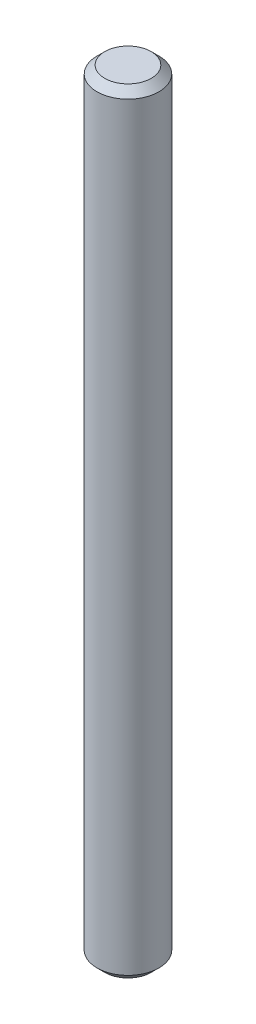
ISO-10303-21;
HEADER;
FILE_DESCRIPTION(('STEP AP214'),'2;1');
FILE_NAME('part.step','',(''),(''),'','','');
FILE_SCHEMA(('AUTOMOTIVE_DESIGN { 1 0 10303 214 1 1 1 1 }'));
ENDSEC;
DATA;
#1=APPLICATION_CONTEXT('core data for automotive mechanical design processes');
#2=APPLICATION_PROTOCOL_DEFINITION('international standard','automotive_design',2000,#1);
#3=PRODUCT_CONTEXT('',#1,'mechanical');
#4=PRODUCT('Part','Part','',(#3));
#5=PRODUCT_RELATED_PRODUCT_CATEGORY('part','',(#4));
#6=PRODUCT_DEFINITION_FORMATION('','',#4);
#7=PRODUCT_DEFINITION_CONTEXT('part definition',#1,'design');
#8=PRODUCT_DEFINITION('design','',#6,#7);
#9=PRODUCT_DEFINITION_SHAPE('','',#8);
#10=(LENGTH_UNIT() NAMED_UNIT(*) SI_UNIT(.MILLI.,.METRE.));
#11=(NAMED_UNIT(*) PLANE_ANGLE_UNIT() SI_UNIT($,.RADIAN.));
#12=(NAMED_UNIT(*) SI_UNIT($,.STERADIAN.) SOLID_ANGLE_UNIT());
#13=UNCERTAINTY_MEASURE_WITH_UNIT(LENGTH_MEASURE(1.E-05),#10,'distance_accuracy_value','');
#14=(GEOMETRIC_REPRESENTATION_CONTEXT(3) GLOBAL_UNCERTAINTY_ASSIGNED_CONTEXT((#13)) GLOBAL_UNIT_ASSIGNED_CONTEXT((#10,
#11,#12)) REPRESENTATION_CONTEXT('',''));
#15=CARTESIAN_POINT('',(0.,0.,0.));
#16=DIRECTION('',(0.,0.,1.));
#17=DIRECTION('',(1.,0.,0.));
#18=AXIS2_PLACEMENT_3D('',#15,#16,#17);
#19=CARTESIAN_POINT('',(0.,50.,0.));
#20=DIRECTION('',(0.,-1.,0.));
#21=DIRECTION('',(0.,0.,-1.));
#22=AXIS2_PLACEMENT_3D('',#19,#20,#21);
#23=CYLINDRICAL_SURFACE('',#22,2.);
#24=CARTESIAN_POINT('',(0.,0.499999999999994,0.));
#25=DIRECTION('',(0.,1.,0.));
#26=DIRECTION('',(0.,0.,1.));
#27=AXIS2_PLACEMENT_3D('',#24,#25,#26);
#28=CIRCLE('',#27,2.);
#29=CARTESIAN_POINT('',(0.,0.499999999999994,2.));
#30=VERTEX_POINT('',#29);
#31=EDGE_CURVE('E42',#30,#30,#28,.T.);
#32=ORIENTED_EDGE('',*,*,#31,.T.);
#33=EDGE_LOOP('',(#32));
#34=FACE_BOUND('',#33,.T.);
#35=CARTESIAN_POINT('',(0.,49.5,0.));
#36=DIRECTION('',(0.,1.,0.));
#37=DIRECTION('',(0.,0.,1.));
#38=AXIS2_PLACEMENT_3D('',#35,#36,#37);
#39=CIRCLE('',#38,2.);
#40=CARTESIAN_POINT('',(0.,49.5,2.));
#41=VERTEX_POINT('',#40);
#42=EDGE_CURVE('E46',#41,#41,#39,.F.);
#43=ORIENTED_EDGE('',*,*,#42,.T.);
#44=EDGE_LOOP('',(#43));
#45=FACE_BOUND('',#44,.T.);
#46=ADVANCED_FACE('F31',(#34,#45),#23,.T.);
#47=CARTESIAN_POINT('',(0.,50.,0.));
#48=DIRECTION('',(0.,1.,0.));
#49=DIRECTION('',(0.,0.,1.));
#50=AXIS2_PLACEMENT_3D('',#47,#48,#49);
#51=PLANE('',#50);
#52=CARTESIAN_POINT('',(0.,50.,0.));
#53=DIRECTION('',(0.,1.,0.));
#54=DIRECTION('',(0.,0.,1.));
#55=AXIS2_PLACEMENT_3D('',#52,#53,#54);
#56=CIRCLE('',#55,1.50000000000001);
#57=CARTESIAN_POINT('',(0.,50.,1.50000000000001));
#58=VERTEX_POINT('',#57);
#59=EDGE_CURVE('E10',#58,#58,#56,.T.);
#60=ORIENTED_EDGE('',*,*,#59,.T.);
#61=EDGE_LOOP('',(#60));
#62=FACE_BOUND('',#61,.T.);
#63=ADVANCED_FACE('F62',(#62),#51,.T.);
#64=CARTESIAN_POINT('',(0.,0.,0.));
#65=DIRECTION('',(0.,1.,0.));
#66=DIRECTION('',(0.,0.,1.));
#67=AXIS2_PLACEMENT_3D('',#64,#65,#66);
#68=PLANE('',#67);
#69=CARTESIAN_POINT('',(0.,0.,0.));
#70=DIRECTION('',(0.,1.,0.));
#71=DIRECTION('',(0.,0.,1.));
#72=AXIS2_PLACEMENT_3D('',#69,#70,#71);
#73=CIRCLE('',#72,1.50000000000001);
#74=CARTESIAN_POINT('',(0.,0.,1.50000000000001));
#75=VERTEX_POINT('',#74);
#76=EDGE_CURVE('E38',#75,#75,#73,.F.);
#77=ORIENTED_EDGE('',*,*,#76,.T.);
#78=EDGE_LOOP('',(#77));
#79=FACE_BOUND('',#78,.T.);
#80=ADVANCED_FACE('F59',(#79),#68,.F.);
#81=CARTESIAN_POINT('',(0.,0.499999999999994,0.));
#82=DIRECTION('',(0.,1.,0.));
#83=DIRECTION('',(0.,0.,1.));
#84=AXIS2_PLACEMENT_3D('',#81,#82,#83);
#85=CONICAL_SURFACE('',#84,2.,0.785398163397447);
#86=ORIENTED_EDGE('',*,*,#76,.F.);
#87=EDGE_LOOP('',(#86));
#88=FACE_BOUND('',#87,.T.);
#89=ORIENTED_EDGE('',*,*,#31,.F.);
#90=EDGE_LOOP('',(#89));
#91=FACE_BOUND('',#90,.T.);
#92=ADVANCED_FACE('F55',(#88,#91),#85,.T.);
#93=CARTESIAN_POINT('',(0.,50.,0.));
#94=DIRECTION('',(0.,-1.,0.));
#95=DIRECTION('',(0.,0.,-1.));
#96=AXIS2_PLACEMENT_3D('',#93,#94,#95);
#97=CONICAL_SURFACE('',#96,1.50000000000001,0.78539816339744);
#98=ORIENTED_EDGE('',*,*,#42,.F.);
#99=EDGE_LOOP('',(#98));
#100=FACE_BOUND('',#99,.T.);
#101=ORIENTED_EDGE('',*,*,#59,.F.);
#102=EDGE_LOOP('',(#101));
#103=FACE_BOUND('',#102,.T.);
#104=ADVANCED_FACE('F33',(#100,#103),#97,.T.);
#105=CLOSED_SHELL('',(#46,#63,#80,#92,#104));
#106=MANIFOLD_SOLID_BREP('B2',#105);
#107=ADVANCED_BREP_SHAPE_REPRESENTATION('',(#18,#106),#14);
#108=SHAPE_DEFINITION_REPRESENTATION(#9,#107);
ENDSEC;
END-ISO-10303-21;
